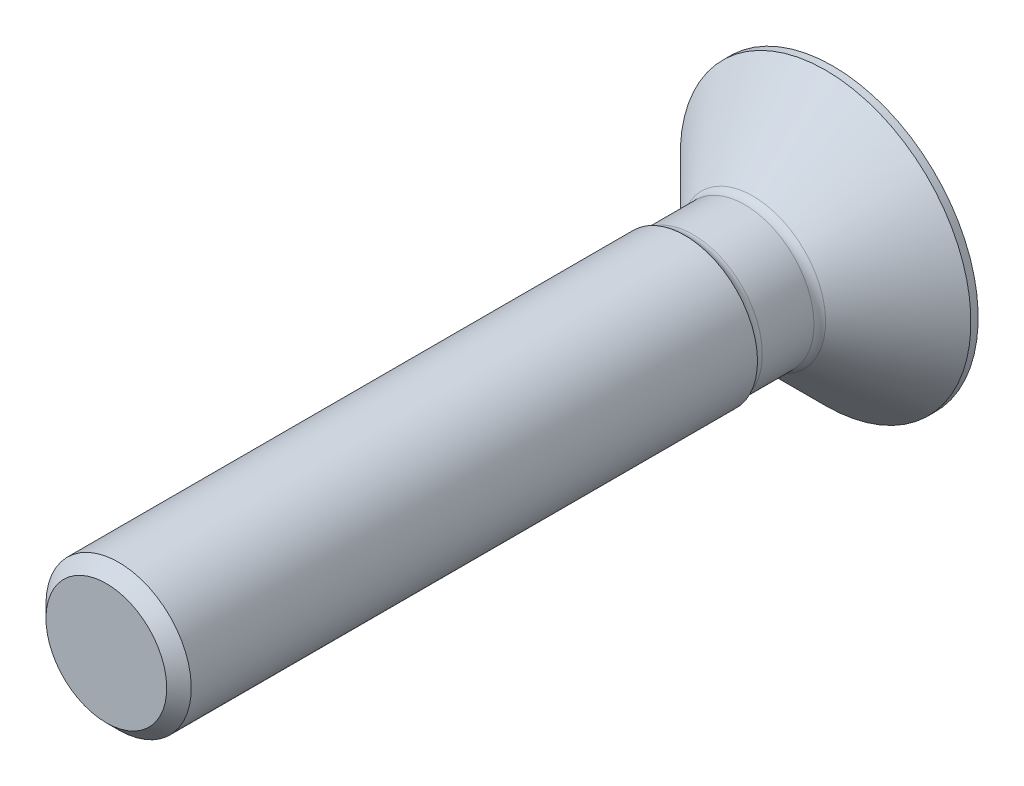
ISO-10303-21;
HEADER;
FILE_DESCRIPTION(('STEP AP214'),'2;1');
FILE_NAME('part.step','',(''),(''),'','','');
FILE_SCHEMA(('AUTOMOTIVE_DESIGN { 1 0 10303 214 1 1 1 1 }'));
ENDSEC;
DATA;
#1=APPLICATION_CONTEXT('core data for automotive mechanical design processes');
#2=APPLICATION_PROTOCOL_DEFINITION('international standard','automotive_design',2000,#1);
#3=PRODUCT_CONTEXT('',#1,'mechanical');
#4=PRODUCT('Part','Part','',(#3));
#5=PRODUCT_RELATED_PRODUCT_CATEGORY('part','',(#4));
#6=PRODUCT_DEFINITION_FORMATION('','',#4);
#7=PRODUCT_DEFINITION_CONTEXT('part definition',#1,'design');
#8=PRODUCT_DEFINITION('design','',#6,#7);
#9=PRODUCT_DEFINITION_SHAPE('','',#8);
#10=(LENGTH_UNIT() NAMED_UNIT(*) SI_UNIT(.MILLI.,.METRE.));
#11=(NAMED_UNIT(*) PLANE_ANGLE_UNIT() SI_UNIT($,.RADIAN.));
#12=(NAMED_UNIT(*) SI_UNIT($,.STERADIAN.) SOLID_ANGLE_UNIT());
#13=UNCERTAINTY_MEASURE_WITH_UNIT(LENGTH_MEASURE(1.E-05),#10,'distance_accuracy_value','');
#14=(GEOMETRIC_REPRESENTATION_CONTEXT(3) GLOBAL_UNCERTAINTY_ASSIGNED_CONTEXT((#13)) GLOBAL_UNIT_ASSIGNED_CONTEXT((#10,
#11,#12)) REPRESENTATION_CONTEXT('',''));
#15=CARTESIAN_POINT('',(0.,0.,0.));
#16=DIRECTION('',(0.,0.,1.));
#17=DIRECTION('',(1.,0.,0.));
#18=AXIS2_PLACEMENT_3D('',#15,#16,#17);
#19=CARTESIAN_POINT('',(0.,-1.66171875,35.6));
#20=DIRECTION('',(0.,0.,1.));
#21=DIRECTION('',(0.,-1.,0.));
#22=AXIS2_PLACEMENT_3D('',#19,#20,#21);
#23=PLANE('',#22);
#24=CARTESIAN_POINT('',(0.,0.,35.6));
#25=DIRECTION('',(0.,0.,1.));
#26=DIRECTION('',(0.,-1.,0.));
#27=AXIS2_PLACEMENT_3D('',#24,#25,#26);
#28=CIRCLE('',#27,3.3234375);
#29=CARTESIAN_POINT('',(0.,-3.3234375,35.6));
#30=VERTEX_POINT('',#29);
#31=EDGE_CURVE('E10',#30,#30,#28,.T.);
#32=ORIENTED_EDGE('',*,*,#31,.T.);
#33=EDGE_LOOP('',(#32));
#34=FACE_BOUND('',#33,.T.);
#35=ADVANCED_FACE('F16',(#34),#23,.T.);
#36=CARTESIAN_POINT('',(0.,0.,35.26171875));
#37=DIRECTION('',(0.,0.,-1.));
#38=DIRECTION('',(0.,-1.,0.));
#39=AXIS2_PLACEMENT_3D('',#36,#37,#38);
#40=CONICAL_SURFACE('',#39,3.66171875,0.785398163397446);
#41=CARTESIAN_POINT('',(0.,0.,34.9234375));
#42=DIRECTION('',(0.,0.,1.));
#43=DIRECTION('',(0.,-1.,0.));
#44=AXIS2_PLACEMENT_3D('',#41,#42,#43);
#45=CIRCLE('',#44,4.);
#46=CARTESIAN_POINT('',(0.,-4.,34.9234375));
#47=VERTEX_POINT('',#46);
#48=EDGE_CURVE('E26',#47,#47,#45,.T.);
#49=ORIENTED_EDGE('',*,*,#48,.T.);
#50=EDGE_LOOP('',(#49));
#51=FACE_BOUND('',#50,.T.);
#52=ORIENTED_EDGE('',*,*,#31,.F.);
#53=EDGE_LOOP('',(#52));
#54=FACE_BOUND('',#53,.T.);
#55=ADVANCED_FACE('F223',(#51,#54),#40,.T.);
#56=CARTESIAN_POINT('',(0.,0.,19.33671875));
#57=DIRECTION('',(0.,0.,-1.));
#58=DIRECTION('',(0.,-1.,0.));
#59=AXIS2_PLACEMENT_3D('',#56,#57,#58);
#60=CYLINDRICAL_SURFACE('',#59,4.);
#61=CARTESIAN_POINT('',(0.,0.,3.75));
#62=DIRECTION('',(0.,0.,1.));
#63=DIRECTION('',(0.,-1.,0.));
#64=AXIS2_PLACEMENT_3D('',#61,#62,#63);
#65=CIRCLE('',#64,4.);
#66=CARTESIAN_POINT('',(0.,-4.,3.75));
#67=VERTEX_POINT('',#66);
#68=EDGE_CURVE('E92',#67,#67,#65,.T.);
#69=ORIENTED_EDGE('',*,*,#68,.T.);
#70=EDGE_LOOP('',(#69));
#71=FACE_BOUND('',#70,.T.);
#72=ORIENTED_EDGE('',*,*,#48,.F.);
#73=EDGE_LOOP('',(#72));
#74=FACE_BOUND('',#73,.T.);
#75=ADVANCED_FACE('F93',(#71,#74),#60,.T.);
#76=CARTESIAN_POINT('',(0.,0.,3.2974516600406));
#77=DIRECTION('',(0.,0.,1.));
#78=DIRECTION('',(-1.,0.,0.));
#79=AXIS2_PLACEMENT_3D('',#76,#77,#78);
#80=TOROIDAL_SURFACE('',#79,4.4525483399594,0.64);
#81=CARTESIAN_POINT('',(0.,0.,3.2974516600406));
#82=DIRECTION('',(0.,0.,1.));
#83=DIRECTION('',(0.,-1.,0.));
#84=AXIS2_PLACEMENT_3D('',#81,#82,#83);
#85=CIRCLE('',#84,3.81254833995939);
#86=CARTESIAN_POINT('',(0.,-3.81254833995939,3.2974516600406));
#87=VERTEX_POINT('',#86);
#88=EDGE_CURVE('E88',#87,#87,#85,.T.);
#89=ORIENTED_EDGE('',*,*,#88,.T.);
#90=EDGE_LOOP('',(#89));
#91=FACE_BOUND('',#90,.T.);
#92=ORIENTED_EDGE('',*,*,#68,.F.);
#93=EDGE_LOOP('',(#92));
#94=FACE_BOUND('',#93,.T.);
#95=ADVANCED_FACE('F243',(#91,#94),#80,.F.);
#96=CARTESIAN_POINT('',(0.,0.,1.875));
#97=DIRECTION('',(0.,0.,-1.));
#98=DIRECTION('',(0.,-1.,0.));
#99=AXIS2_PLACEMENT_3D('',#96,#97,#98);
#100=CYLINDRICAL_SURFACE('',#99,3.81254833995939);
#101=CARTESIAN_POINT('',(0.,0.,0.452548339959391));
#102=DIRECTION('',(0.,0.,1.));
#103=DIRECTION('',(0.,-1.,0.));
#104=AXIS2_PLACEMENT_3D('',#101,#102,#103);
#105=CIRCLE('',#104,3.81254833995939);
#106=CARTESIAN_POINT('',(0.,-3.81254833995939,0.452548339959391));
#107=VERTEX_POINT('',#106);
#108=EDGE_CURVE('E97',#107,#107,#105,.T.);
#109=ORIENTED_EDGE('',*,*,#108,.T.);
#110=EDGE_LOOP('',(#109));
#111=FACE_BOUND('',#110,.T.);
#112=ORIENTED_EDGE('',*,*,#88,.F.);
#113=EDGE_LOOP('',(#112));
#114=FACE_BOUND('',#113,.T.);
#115=ADVANCED_FACE('F238',(#111,#114),#100,.T.);
#116=CARTESIAN_POINT('',(0.,0.,0.45254833995939));
#117=DIRECTION('',(0.,0.,1.));
#118=DIRECTION('',(-1.,0.,0.));
#119=AXIS2_PLACEMENT_3D('',#116,#117,#118);
#120=TOROIDAL_SURFACE('',#119,4.45254833995939,0.64);
#121=CARTESIAN_POINT('',(0.,0.,0.));
#122=DIRECTION('',(0.,0.,1.));
#123=DIRECTION('',(0.,-1.,0.));
#124=AXIS2_PLACEMENT_3D('',#121,#122,#123);
#125=CIRCLE('',#124,4.);
#126=CARTESIAN_POINT('',(0.,-4.,0.));
#127=VERTEX_POINT('',#126);
#128=EDGE_CURVE('E129',#127,#127,#125,.T.);
#129=ORIENTED_EDGE('',*,*,#128,.T.);
#130=EDGE_LOOP('',(#129));
#131=FACE_BOUND('',#130,.T.);
#132=ORIENTED_EDGE('',*,*,#108,.F.);
#133=EDGE_LOOP('',(#132));
#134=FACE_BOUND('',#133,.T.);
#135=ADVANCED_FACE('F235',(#131,#134),#120,.F.);
#136=CARTESIAN_POINT('',(0.,0.,-2.));
#137=DIRECTION('',(0.,0.,-1.));
#138=DIRECTION('',(0.,-1.,0.));
#139=AXIS2_PLACEMENT_3D('',#136,#137,#138);
#140=CONICAL_SURFACE('',#139,6.,0.785398163397449);
#141=CARTESIAN_POINT('',(0.,0.,-4.));
#142=DIRECTION('',(0.,0.,1.));
#143=DIRECTION('',(0.,-1.,0.));
#144=AXIS2_PLACEMENT_3D('',#141,#142,#143);
#145=CIRCLE('',#144,8.);
#146=CARTESIAN_POINT('',(0.,-8.,-4.));
#147=VERTEX_POINT('',#146);
#148=EDGE_CURVE('E127',#147,#147,#145,.T.);
#149=ORIENTED_EDGE('',*,*,#148,.T.);
#150=EDGE_LOOP('',(#149));
#151=FACE_BOUND('',#150,.T.);
#152=ORIENTED_EDGE('',*,*,#128,.F.);
#153=EDGE_LOOP('',(#152));
#154=FACE_BOUND('',#153,.T.);
#155=ADVANCED_FACE('F18',(#151,#154),#140,.T.);
#156=CARTESIAN_POINT('',(0.,0.,-4.2));
#157=DIRECTION('',(0.,0.,-1.));
#158=DIRECTION('',(0.,-1.,0.));
#159=AXIS2_PLACEMENT_3D('',#156,#157,#158);
#160=CYLINDRICAL_SURFACE('',#159,8.);
#161=CARTESIAN_POINT('',(0.,0.,-4.4));
#162=DIRECTION('',(0.,0.,1.));
#163=DIRECTION('',(0.,-1.,0.));
#164=AXIS2_PLACEMENT_3D('',#161,#162,#163);
#165=CIRCLE('',#164,8.);
#166=CARTESIAN_POINT('',(0.,-8.,-4.4));
#167=VERTEX_POINT('',#166);
#168=EDGE_CURVE('E130',#167,#167,#165,.T.);
#169=ORIENTED_EDGE('',*,*,#168,.T.);
#170=EDGE_LOOP('',(#169));
#171=FACE_BOUND('',#170,.T.);
#172=ORIENTED_EDGE('',*,*,#148,.F.);
#173=EDGE_LOOP('',(#172));
#174=FACE_BOUND('',#173,.T.);
#175=ADVANCED_FACE('F256',(#171,#174),#160,.T.);
#176=CARTESIAN_POINT('',(0.,-4.,-4.4));
#177=DIRECTION('',(0.,0.,-1.));
#178=DIRECTION('',(0.,1.,0.));
#179=AXIS2_PLACEMENT_3D('',#176,#177,#178);
#180=PLANE('',#179);
#181=ORIENTED_EDGE('',*,*,#168,.F.);
#182=EDGE_LOOP('',(#181));
#183=FACE_BOUND('',#182,.T.);
#184=DIRECTION('',(-0.5,-0.866025403784439,0.));
#185=VECTOR('',#184,1.);
#186=CARTESIAN_POINT('',(-3.03165040378444,-0.249675823286216,-4.4));
#187=LINE('',#186,#185);
#188=CARTESIAN_POINT('',(-1.44375,2.50064835342757,-4.4));
#189=VERTEX_POINT('',#188);
#190=CARTESIAN_POINT('',(-2.8875,0.,-4.4));
#191=VERTEX_POINT('',#190);
#192=EDGE_CURVE('E20',#189,#191,#187,.T.);
#193=ORIENTED_EDGE('',*,*,#192,.T.);
#194=DIRECTION('',(0.5,-0.866025403784439,0.));
#195=VECTOR('',#194,1.);
#196=CARTESIAN_POINT('',(-1.29959959621556,-2.75032417671378,-4.4));
#197=LINE('',#196,#195);
#198=CARTESIAN_POINT('',(-1.44375,-2.50064835342757,-4.4));
#199=VERTEX_POINT('',#198);
#200=EDGE_CURVE('E158',#191,#199,#197,.T.);
#201=ORIENTED_EDGE('',*,*,#200,.T.);
#202=DIRECTION('',(1.,0.,0.));
#203=VECTOR('',#202,1.);
#204=CARTESIAN_POINT('',(0.,-2.50064835342757,-4.4));
#205=LINE('',#204,#203);
#206=CARTESIAN_POINT('',(1.44375,-2.50064835342757,-4.4));
#207=VERTEX_POINT('',#206);
#208=EDGE_CURVE('E111',#199,#207,#205,.T.);
#209=ORIENTED_EDGE('',*,*,#208,.T.);
#210=DIRECTION('',(0.5,0.866025403784439,0.));
#211=VECTOR('',#210,1.);
#212=CARTESIAN_POINT('',(1.29959959621556,-2.75032417671378,-4.4));
#213=LINE('',#212,#211);
#214=CARTESIAN_POINT('',(2.8875,0.,-4.4));
#215=VERTEX_POINT('',#214);
#216=EDGE_CURVE('E112',#207,#215,#213,.T.);
#217=ORIENTED_EDGE('',*,*,#216,.T.);
#218=DIRECTION('',(-0.5,0.866025403784439,0.));
#219=VECTOR('',#218,1.);
#220=CARTESIAN_POINT('',(3.03165040378444,-0.249675823286217,-4.4));
#221=LINE('',#220,#219);
#222=CARTESIAN_POINT('',(1.44375,2.50064835342757,-4.4));
#223=VERTEX_POINT('',#222);
#224=EDGE_CURVE('E115',#215,#223,#221,.T.);
#225=ORIENTED_EDGE('',*,*,#224,.T.);
#226=DIRECTION('',(-1.,0.,0.));
#227=VECTOR('',#226,1.);
#228=CARTESIAN_POINT('',(0.,2.50064835342757,-4.4));
#229=LINE('',#228,#227);
#230=EDGE_CURVE('E116',#223,#189,#229,.T.);
#231=ORIENTED_EDGE('',*,*,#230,.T.);
#232=EDGE_LOOP('',(#193,#201,#209,#217,#225,#231));
#233=FACE_BOUND('',#232,.T.);
#234=ADVANCED_FACE('F181',(#183,#233),#180,.T.);
#235=CARTESIAN_POINT('',(-2.165625,-1.25032417671378,-4.4));
#236=DIRECTION('',(-0.866025403784439,-0.5,0.));
#237=DIRECTION('',(0.5,-0.866025403784439,0.));
#238=AXIS2_PLACEMENT_3D('',#235,#236,#237);
#239=PLANE('',#238);
#240=CARTESIAN_POINT('',(-2.8875,0.,-0.9));
#241=CARTESIAN_POINT('',(-2.165625,-1.25032417671378,-0.483225274428739));
#242=CARTESIAN_POINT('',(-1.44375,-2.50064835342757,-0.9));
#243=(BOUNDED_CURVE() B_SPLINE_CURVE(2,(#240,#241,#242),.UNSPECIFIED.,.F.,
.F.) B_SPLINE_CURVE_WITH_KNOTS((3,3),(0.,2.92184790476981),
.UNSPECIFIED.) CURVE() GEOMETRIC_REPRESENTATION_ITEM() RATIONAL_B_SPLINE_CURVE((1.,
1.15470053837925,1.)) REPRESENTATION_ITEM(''));
#244=CARTESIAN_POINT('',(-2.8875,0.,-0.9));
#245=VERTEX_POINT('',#244);
#246=CARTESIAN_POINT('',(-1.44375,-2.50064835342757,-0.9));
#247=VERTEX_POINT('',#246);
#248=EDGE_CURVE('E106',#245,#247,#243,.T.);
#249=ORIENTED_EDGE('',*,*,#248,.T.);
#250=DIRECTION('',(0.,0.,1.));
#251=VECTOR('',#250,1.);
#252=CARTESIAN_POINT('',(-1.44375,-2.50064835342757,-4.4));
#253=LINE('',#252,#251);
#254=EDGE_CURVE('E141',#199,#247,#253,.T.);
#255=ORIENTED_EDGE('',*,*,#254,.F.);
#256=ORIENTED_EDGE('',*,*,#200,.F.);
#257=DIRECTION('',(0.,0.,1.));
#258=VECTOR('',#257,1.);
#259=CARTESIAN_POINT('',(-2.8875,0.,-4.4));
#260=LINE('',#259,#258);
#261=EDGE_CURVE('E165',#191,#245,#260,.T.);
#262=ORIENTED_EDGE('',*,*,#261,.T.);
#263=EDGE_LOOP('',(#249,#255,#256,#262));
#264=FACE_BOUND('',#263,.T.);
#265=ADVANCED_FACE('F186',(#264),#239,.F.);
#266=CARTESIAN_POINT('',(0.,-2.50064835342757,-4.4));
#267=DIRECTION('',(0.,-1.,0.));
#268=DIRECTION('',(1.,0.,0.));
#269=AXIS2_PLACEMENT_3D('',#266,#267,#268);
#270=PLANE('',#269);
#271=CARTESIAN_POINT('',(-1.44375,-2.50064835342757,-0.9));
#272=CARTESIAN_POINT('',(0.,-2.50064835342756,-0.483225274428738));
#273=CARTESIAN_POINT('',(1.44375,-2.50064835342757,-0.9));
#274=(BOUNDED_CURVE() B_SPLINE_CURVE(2,(#271,#272,#273),.UNSPECIFIED.,.F.,
.F.) B_SPLINE_CURVE_WITH_KNOTS((3,3),(0.,2.92184790476982),
.UNSPECIFIED.) CURVE() GEOMETRIC_REPRESENTATION_ITEM() RATIONAL_B_SPLINE_CURVE((1.,
1.15470053837925,1.)) REPRESENTATION_ITEM(''));
#275=CARTESIAN_POINT('',(1.44375,-2.50064835342757,-0.9));
#276=VERTEX_POINT('',#275);
#277=EDGE_CURVE('E117',#247,#276,#274,.T.);
#278=ORIENTED_EDGE('',*,*,#277,.T.);
#279=DIRECTION('',(0.,0.,1.));
#280=VECTOR('',#279,1.);
#281=CARTESIAN_POINT('',(1.44375,-2.50064835342757,-4.4));
#282=LINE('',#281,#280);
#283=EDGE_CURVE('E64',#207,#276,#282,.T.);
#284=ORIENTED_EDGE('',*,*,#283,.F.);
#285=ORIENTED_EDGE('',*,*,#208,.F.);
#286=ORIENTED_EDGE('',*,*,#254,.T.);
#287=EDGE_LOOP('',(#278,#284,#285,#286));
#288=FACE_BOUND('',#287,.T.);
#289=ADVANCED_FACE('F190',(#288),#270,.F.);
#290=CARTESIAN_POINT('',(2.165625,-1.25032417671378,-4.4));
#291=DIRECTION('',(0.866025403784439,-0.5,0.));
#292=DIRECTION('',(0.5,0.866025403784439,0.));
#293=AXIS2_PLACEMENT_3D('',#290,#291,#292);
#294=PLANE('',#293);
#295=CARTESIAN_POINT('',(1.44375,-2.50064835342757,-0.9));
#296=CARTESIAN_POINT('',(2.165625,-1.25032417671378,-0.48322527442874));
#297=CARTESIAN_POINT('',(2.8875,0.,-0.9));
#298=(BOUNDED_CURVE() B_SPLINE_CURVE(2,(#295,#296,#297),.UNSPECIFIED.,.F.,
.F.) B_SPLINE_CURVE_WITH_KNOTS((3,3),(0.,2.9218479047698),
.UNSPECIFIED.) CURVE() GEOMETRIC_REPRESENTATION_ITEM() RATIONAL_B_SPLINE_CURVE((1.,
1.15470053837925,1.)) REPRESENTATION_ITEM(''));
#299=CARTESIAN_POINT('',(2.8875,0.,-0.9));
#300=VERTEX_POINT('',#299);
#301=EDGE_CURVE('E121',#276,#300,#298,.T.);
#302=ORIENTED_EDGE('',*,*,#301,.T.);
#303=DIRECTION('',(0.,0.,1.));
#304=VECTOR('',#303,1.);
#305=CARTESIAN_POINT('',(2.8875,0.,-4.4));
#306=LINE('',#305,#304);
#307=EDGE_CURVE('E122',#215,#300,#306,.T.);
#308=ORIENTED_EDGE('',*,*,#307,.F.);
#309=ORIENTED_EDGE('',*,*,#216,.F.);
#310=ORIENTED_EDGE('',*,*,#283,.T.);
#311=EDGE_LOOP('',(#302,#308,#309,#310));
#312=FACE_BOUND('',#311,.T.);
#313=ADVANCED_FACE('F194',(#312),#294,.F.);
#314=CARTESIAN_POINT('',(2.165625,1.25032417671378,-4.4));
#315=DIRECTION('',(0.866025403784439,0.5,0.));
#316=DIRECTION('',(-0.5,0.866025403784439,0.));
#317=AXIS2_PLACEMENT_3D('',#314,#315,#316);
#318=PLANE('',#317);
#319=CARTESIAN_POINT('',(2.8875,0.,-0.9));
#320=CARTESIAN_POINT('',(2.165625,1.25032417671378,-0.48322527442874));
#321=CARTESIAN_POINT('',(1.44375,2.50064835342757,-0.9));
#322=(BOUNDED_CURVE() B_SPLINE_CURVE(2,(#319,#320,#321),.UNSPECIFIED.,.F.,
.F.) B_SPLINE_CURVE_WITH_KNOTS((3,3),(0.,2.9218479047698),
.UNSPECIFIED.) CURVE() GEOMETRIC_REPRESENTATION_ITEM() RATIONAL_B_SPLINE_CURVE((1.,
1.15470053837925,1.)) REPRESENTATION_ITEM(''));
#323=CARTESIAN_POINT('',(1.44375,2.50064835342757,-0.9));
#324=VERTEX_POINT('',#323);
#325=EDGE_CURVE('E135',#300,#324,#322,.T.);
#326=ORIENTED_EDGE('',*,*,#325,.T.);
#327=DIRECTION('',(0.,0.,1.));
#328=VECTOR('',#327,1.);
#329=CARTESIAN_POINT('',(1.44375,2.50064835342757,-4.4));
#330=LINE('',#329,#328);
#331=EDGE_CURVE('E113',#223,#324,#330,.T.);
#332=ORIENTED_EDGE('',*,*,#331,.F.);
#333=ORIENTED_EDGE('',*,*,#224,.F.);
#334=ORIENTED_EDGE('',*,*,#307,.T.);
#335=EDGE_LOOP('',(#326,#332,#333,#334));
#336=FACE_BOUND('',#335,.T.);
#337=ADVANCED_FACE('F211',(#336),#318,.F.);
#338=CARTESIAN_POINT('',(0.,2.50064835342757,-4.4));
#339=DIRECTION('',(0.,1.,0.));
#340=DIRECTION('',(-1.,0.,0.));
#341=AXIS2_PLACEMENT_3D('',#338,#339,#340);
#342=PLANE('',#341);
#343=CARTESIAN_POINT('',(1.44375,2.50064835342757,-0.9));
#344=CARTESIAN_POINT('',(0.,2.50064835342756,-0.483225274428739));
#345=CARTESIAN_POINT('',(-1.44375,2.50064835342757,-0.9));
#346=(BOUNDED_CURVE() B_SPLINE_CURVE(2,(#343,#344,#345),.UNSPECIFIED.,.F.,
.F.) B_SPLINE_CURVE_WITH_KNOTS((3,3),(0.,2.92184790476981),
.UNSPECIFIED.) CURVE() GEOMETRIC_REPRESENTATION_ITEM() RATIONAL_B_SPLINE_CURVE((1.,
1.15470053837925,1.)) REPRESENTATION_ITEM(''));
#347=CARTESIAN_POINT('',(-1.44375,2.50064835342757,-0.9));
#348=VERTEX_POINT('',#347);
#349=EDGE_CURVE('E105',#324,#348,#346,.T.);
#350=ORIENTED_EDGE('',*,*,#349,.T.);
#351=DIRECTION('',(0.,0.,1.));
#352=VECTOR('',#351,1.);
#353=CARTESIAN_POINT('',(-1.44375,2.50064835342757,-4.4));
#354=LINE('',#353,#352);
#355=EDGE_CURVE('E170',#189,#348,#354,.T.);
#356=ORIENTED_EDGE('',*,*,#355,.F.);
#357=ORIENTED_EDGE('',*,*,#230,.F.);
#358=ORIENTED_EDGE('',*,*,#331,.T.);
#359=EDGE_LOOP('',(#350,#356,#357,#358));
#360=FACE_BOUND('',#359,.T.);
#361=ADVANCED_FACE('F206',(#360),#342,.F.);
#362=CARTESIAN_POINT('',(-2.165625,1.25032417671378,-4.4));
#363=DIRECTION('',(-0.866025403784439,0.5,0.));
#364=DIRECTION('',(-0.5,-0.866025403784439,0.));
#365=AXIS2_PLACEMENT_3D('',#362,#363,#364);
#366=PLANE('',#365);
#367=CARTESIAN_POINT('',(-1.44375,2.50064835342757,-0.9));
#368=CARTESIAN_POINT('',(-2.165625,1.25032417671378,-0.48322527442874));
#369=CARTESIAN_POINT('',(-2.8875,0.,-0.9));
#370=(BOUNDED_CURVE() B_SPLINE_CURVE(2,(#367,#368,#369),.UNSPECIFIED.,.F.,
.F.) B_SPLINE_CURVE_WITH_KNOTS((3,3),(0.,2.9218479047698),
.UNSPECIFIED.) CURVE() GEOMETRIC_REPRESENTATION_ITEM() RATIONAL_B_SPLINE_CURVE((1.,
1.15470053837925,1.)) REPRESENTATION_ITEM(''));
#371=EDGE_CURVE('E100',#348,#245,#370,.T.);
#372=ORIENTED_EDGE('',*,*,#371,.T.);
#373=ORIENTED_EDGE('',*,*,#261,.F.);
#374=ORIENTED_EDGE('',*,*,#192,.F.);
#375=ORIENTED_EDGE('',*,*,#355,.T.);
#376=EDGE_LOOP('',(#372,#373,#374,#375));
#377=FACE_BOUND('',#376,.T.);
#378=ADVANCED_FACE('F201',(#377),#366,.F.);
#379=CARTESIAN_POINT('',(0.,0.,-0.0664505488574783));
#380=DIRECTION('',(0.,0.,-1.));
#381=DIRECTION('',(0.,-1.,0.));
#382=AXIS2_PLACEMENT_3D('',#379,#380,#381);
#383=CONICAL_SURFACE('',#382,1.44375,1.0471975511966);
#384=CARTESIAN_POINT('',(0.,0.,0.767098902285044));
#385=VERTEX_POINT('',#384);
#386=VERTEX_LOOP('',#385);
#387=FACE_BOUND('',#386,.T.);
#388=ORIENTED_EDGE('',*,*,#301,.F.);
#389=ORIENTED_EDGE('',*,*,#277,.F.);
#390=ORIENTED_EDGE('',*,*,#248,.F.);
#391=ORIENTED_EDGE('',*,*,#371,.F.);
#392=ORIENTED_EDGE('',*,*,#349,.F.);
#393=ORIENTED_EDGE('',*,*,#325,.F.);
#394=EDGE_LOOP('',(#388,#389,#390,#391,#392,#393));
#395=FACE_BOUND('',#394,.T.);
#396=ADVANCED_FACE('F209',(#387,#395),#383,.F.);
#397=CLOSED_SHELL('',(#35,#55,#75,#95,#115,#135,#155,#175,#234,#265,#289,#313,#337,#361,#378,#396));
#398=MANIFOLD_SOLID_BREP('B1',#397);
#399=ADVANCED_BREP_SHAPE_REPRESENTATION('',(#18,#398),#14);
#400=SHAPE_DEFINITION_REPRESENTATION(#9,#399);
ENDSEC;
END-ISO-10303-21;
